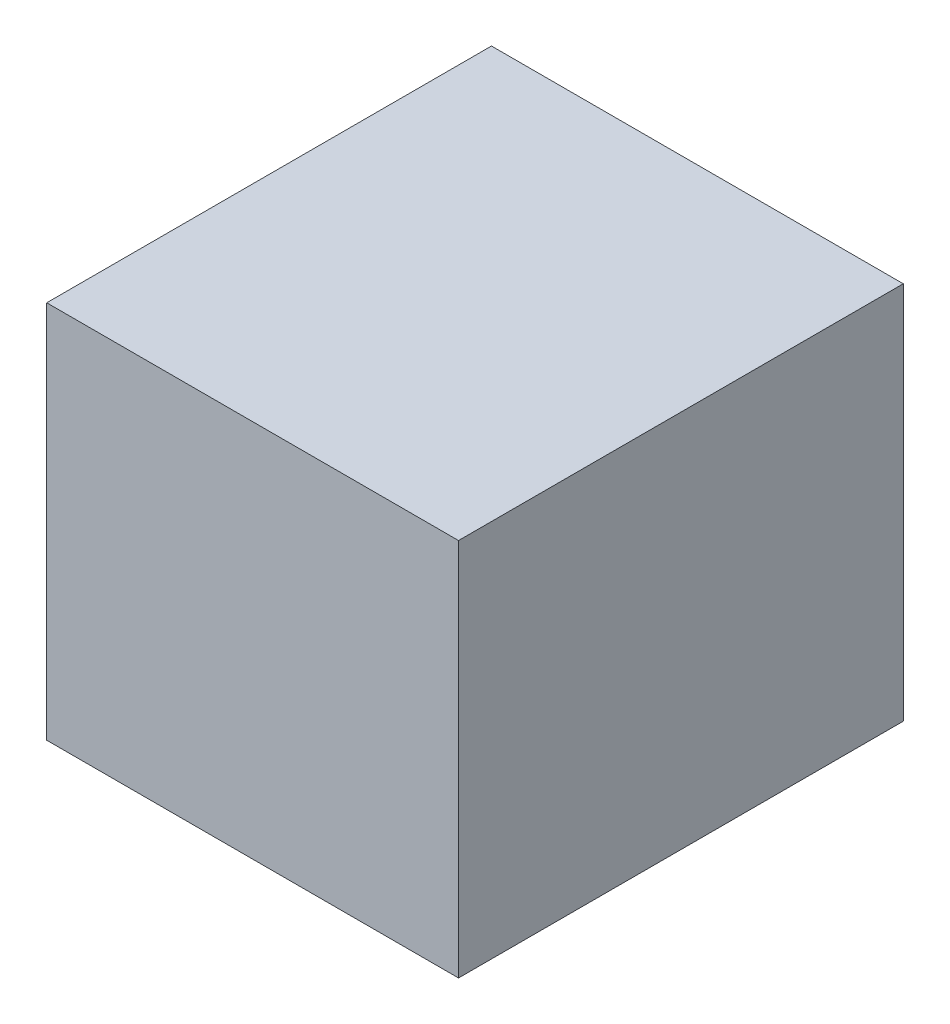
ISO-10303-21;
HEADER;
FILE_DESCRIPTION(('STEP AP214'),'2;1');
FILE_NAME('part.step','',(''),(''),'','','');
FILE_SCHEMA(('AUTOMOTIVE_DESIGN { 1 0 10303 214 1 1 1 1 }'));
ENDSEC;
DATA;
#1=APPLICATION_CONTEXT('core data for automotive mechanical design processes');
#2=APPLICATION_PROTOCOL_DEFINITION('international standard','automotive_design',2000,#1);
#3=PRODUCT_CONTEXT('',#1,'mechanical');
#4=PRODUCT('Part','Part','',(#3));
#5=PRODUCT_RELATED_PRODUCT_CATEGORY('part','',(#4));
#6=PRODUCT_DEFINITION_FORMATION('','',#4);
#7=PRODUCT_DEFINITION_CONTEXT('part definition',#1,'design');
#8=PRODUCT_DEFINITION('design','',#6,#7);
#9=PRODUCT_DEFINITION_SHAPE('','',#8);
#10=(LENGTH_UNIT() NAMED_UNIT(*) SI_UNIT(.MILLI.,.METRE.));
#11=(NAMED_UNIT(*) PLANE_ANGLE_UNIT() SI_UNIT($,.RADIAN.));
#12=(NAMED_UNIT(*) SI_UNIT($,.STERADIAN.) SOLID_ANGLE_UNIT());
#13=UNCERTAINTY_MEASURE_WITH_UNIT(LENGTH_MEASURE(1.E-05),#10,'distance_accuracy_value','');
#14=(GEOMETRIC_REPRESENTATION_CONTEXT(3) GLOBAL_UNCERTAINTY_ASSIGNED_CONTEXT((#13)) GLOBAL_UNIT_ASSIGNED_CONTEXT((#10,
#11,#12)) REPRESENTATION_CONTEXT('',''));
#15=CARTESIAN_POINT('',(0.,0.,0.));
#16=DIRECTION('',(0.,0.,1.));
#17=DIRECTION('',(1.,0.,0.));
#18=AXIS2_PLACEMENT_3D('',#15,#16,#17);
#19=CARTESIAN_POINT('',(1.25000258,1.15000278,0.));
#20=DIRECTION('',(1.01599893971649E-06,-0.999999999999484,0.));
#21=DIRECTION('',(0.999999999999484,1.01599893971649E-06,0.));
#22=AXIS2_PLACEMENT_3D('',#19,#20,#21);
#23=PLANE('',#22);
#24=DIRECTION('',(0.,0.,1.));
#25=VECTOR('',#24,1.);
#26=CARTESIAN_POINT('',(-1.25000004,1.15000024,0.));
#27=LINE('',#26,#25);
#28=CARTESIAN_POINT('',(-1.250000675,1.15000024,0.));
#29=VERTEX_POINT('',#28);
#30=CARTESIAN_POINT('',(-1.250000675,1.15000024,2.69999968));
#31=VERTEX_POINT('',#30);
#32=EDGE_CURVE('E20',#29,#31,#27,.T.);
#33=ORIENTED_EDGE('',*,*,#32,.T.);
#34=DIRECTION('',(-1.,0.,0.));
#35=VECTOR('',#34,1.);
#36=CARTESIAN_POINT('',(-1.25000258,1.15000024,2.69999968));
#37=LINE('',#36,#35);
#38=CARTESIAN_POINT('',(1.25000258,1.15000151,2.69999968));
#39=VERTEX_POINT('',#38);
#40=EDGE_CURVE('E55',#31,#39,#37,.F.);
#41=ORIENTED_EDGE('',*,*,#40,.T.);
#42=DIRECTION('',(0.,0.,1.));
#43=VECTOR('',#42,1.);
#44=CARTESIAN_POINT('',(1.25000258,1.15000278,0.));
#45=LINE('',#44,#43);
#46=CARTESIAN_POINT('',(1.25000258,1.150002145,0.));
#47=VERTEX_POINT('',#46);
#48=EDGE_CURVE('E76',#39,#47,#45,.F.);
#49=ORIENTED_EDGE('',*,*,#48,.T.);
#50=DIRECTION('',(-1.,0.,0.));
#51=VECTOR('',#50,1.);
#52=CARTESIAN_POINT('',(-1.25000258,1.15000024,0.));
#53=LINE('',#52,#51);
#54=EDGE_CURVE('E58',#29,#47,#53,.F.);
#55=ORIENTED_EDGE('',*,*,#54,.F.);
#56=EDGE_LOOP('',(#33,#41,#49,#55));
#57=FACE_BOUND('',#56,.T.);
#58=ADVANCED_FACE('F17',(#57),#23,.F.);
#59=CARTESIAN_POINT('',(-1.25000004,1.15000024,0.));
#60=DIRECTION('',(0.99999999999939,-1.10434759430843E-06,0.));
#61=DIRECTION('',(1.10434759430843E-06,0.99999999999939,0.));
#62=AXIS2_PLACEMENT_3D('',#59,#60,#61);
#63=PLANE('',#62);
#64=DIRECTION('',(0.,0.,1.));
#65=VECTOR('',#64,1.);
#66=CARTESIAN_POINT('',(-1.25000258,-1.15000024,0.));
#67=LINE('',#66,#65);
#68=CARTESIAN_POINT('',(-1.25000258,-1.149999605,0.));
#69=VERTEX_POINT('',#68);
#70=CARTESIAN_POINT('',(-1.25000258,-1.149999605,2.69999968));
#71=VERTEX_POINT('',#70);
#72=EDGE_CURVE('E73',#69,#71,#67,.T.);
#73=ORIENTED_EDGE('',*,*,#72,.T.);
#74=DIRECTION('',(0.,1.,0.));
#75=VECTOR('',#74,1.);
#76=CARTESIAN_POINT('',(-1.25000258,-1.15000024,2.69999968));
#77=LINE('',#76,#75);
#78=EDGE_CURVE('E63',#71,#31,#77,.T.);
#79=ORIENTED_EDGE('',*,*,#78,.T.);
#80=ORIENTED_EDGE('',*,*,#32,.F.);
#81=DIRECTION('',(0.,1.,0.));
#82=VECTOR('',#81,1.);
#83=CARTESIAN_POINT('',(-1.25000258,-1.15000024,0.));
#84=LINE('',#83,#82);
#85=EDGE_CURVE('E78',#69,#29,#84,.T.);
#86=ORIENTED_EDGE('',*,*,#85,.F.);
#87=EDGE_LOOP('',(#73,#79,#80,#86));
#88=FACE_BOUND('',#87,.T.);
#89=ADVANCED_FACE('F72',(#88),#63,.F.);
#90=CARTESIAN_POINT('',(-1.25000258,-1.15000024,2.69999968));
#91=DIRECTION('',(0.,0.,-1.));
#92=DIRECTION('',(-1.,0.,0.));
#93=AXIS2_PLACEMENT_3D('',#90,#91,#92);
#94=PLANE('',#93);
#95=DIRECTION('',(-1.10434759430843E-06,-0.99999999999939,0.));
#96=VECTOR('',#95,1.);
#97=CARTESIAN_POINT('',(1.25000004,-1.1499977,2.69999968));
#98=LINE('',#97,#96);
#99=CARTESIAN_POINT('',(1.25000131,-1.1499977,2.69999968));
#100=VERTEX_POINT('',#99);
#101=EDGE_CURVE('E69',#100,#39,#98,.F.);
#102=ORIENTED_EDGE('',*,*,#101,.T.);
#103=ORIENTED_EDGE('',*,*,#40,.F.);
#104=ORIENTED_EDGE('',*,*,#78,.F.);
#105=DIRECTION('',(-0.999999999999484,-1.01599893403249E-06,0.));
#106=VECTOR('',#105,1.);
#107=CARTESIAN_POINT('',(-1.25000258,-1.15000024,2.69999968));
#108=LINE('',#107,#106);
#109=EDGE_CURVE('E83',#71,#100,#108,.F.);
#110=ORIENTED_EDGE('',*,*,#109,.T.);
#111=EDGE_LOOP('',(#102,#103,#104,#110));
#112=FACE_BOUND('',#111,.T.);
#113=ADVANCED_FACE('F66',(#112),#94,.F.);
#114=CARTESIAN_POINT('',(1.25000004,-1.1499977,0.));
#115=DIRECTION('',(-0.99999999999939,1.10434759430843E-06,0.));
#116=DIRECTION('',(-1.10434759430843E-06,-0.99999999999939,0.));
#117=AXIS2_PLACEMENT_3D('',#114,#115,#116);
#118=PLANE('',#117);
#119=ORIENTED_EDGE('',*,*,#48,.F.);
#120=ORIENTED_EDGE('',*,*,#101,.F.);
#121=DIRECTION('',(0.,0.,1.));
#122=VECTOR('',#121,1.);
#123=CARTESIAN_POINT('',(1.25000004,-1.1499977,0.));
#124=LINE('',#123,#122);
#125=CARTESIAN_POINT('',(1.250000675,-1.1499977,0.));
#126=VERTEX_POINT('',#125);
#127=EDGE_CURVE('E26',#100,#126,#124,.F.);
#128=ORIENTED_EDGE('',*,*,#127,.T.);
#129=DIRECTION('',(0.,1.,0.));
#130=VECTOR('',#129,1.);
#131=CARTESIAN_POINT('',(1.25000258,-1.15000024,0.));
#132=LINE('',#131,#130);
#133=EDGE_CURVE('E34',#47,#126,#132,.F.);
#134=ORIENTED_EDGE('',*,*,#133,.F.);
#135=EDGE_LOOP('',(#119,#120,#128,#134));
#136=FACE_BOUND('',#135,.T.);
#137=ADVANCED_FACE('F88',(#136),#118,.F.);
#138=CARTESIAN_POINT('',(-1.25000258,-1.15000024,0.));
#139=DIRECTION('',(0.,0.,-1.));
#140=DIRECTION('',(-1.,0.,0.));
#141=AXIS2_PLACEMENT_3D('',#138,#139,#140);
#142=PLANE('',#141);
#143=ORIENTED_EDGE('',*,*,#133,.T.);
#144=DIRECTION('',(-0.999999999999484,-1.01599893403249E-06,0.));
#145=VECTOR('',#144,1.);
#146=CARTESIAN_POINT('',(-1.25000258,-1.15000024,0.));
#147=LINE('',#146,#145);
#148=EDGE_CURVE('E11',#126,#69,#147,.T.);
#149=ORIENTED_EDGE('',*,*,#148,.T.);
#150=ORIENTED_EDGE('',*,*,#85,.T.);
#151=ORIENTED_EDGE('',*,*,#54,.T.);
#152=EDGE_LOOP('',(#143,#149,#150,#151));
#153=FACE_BOUND('',#152,.T.);
#154=ADVANCED_FACE('F91',(#153),#142,.T.);
#155=CARTESIAN_POINT('',(-1.25000258,-1.15000024,0.));
#156=DIRECTION('',(-1.01599893403249E-06,0.999999999999484,0.));
#157=DIRECTION('',(-0.999999999999484,-1.01599893403249E-06,0.));
#158=AXIS2_PLACEMENT_3D('',#155,#156,#157);
#159=PLANE('',#158);
#160=ORIENTED_EDGE('',*,*,#127,.F.);
#161=ORIENTED_EDGE('',*,*,#109,.F.);
#162=ORIENTED_EDGE('',*,*,#72,.F.);
#163=ORIENTED_EDGE('',*,*,#148,.F.);
#164=EDGE_LOOP('',(#160,#161,#162,#163));
#165=FACE_BOUND('',#164,.T.);
#166=ADVANCED_FACE('F90',(#165),#159,.F.);
#167=CLOSED_SHELL('',(#58,#89,#113,#137,#154,#166));
#168=MANIFOLD_SOLID_BREP('B1',#167);
#169=ADVANCED_BREP_SHAPE_REPRESENTATION('',(#18,#168),#14);
#170=SHAPE_DEFINITION_REPRESENTATION(#9,#169);
ENDSEC;
END-ISO-10303-21;
